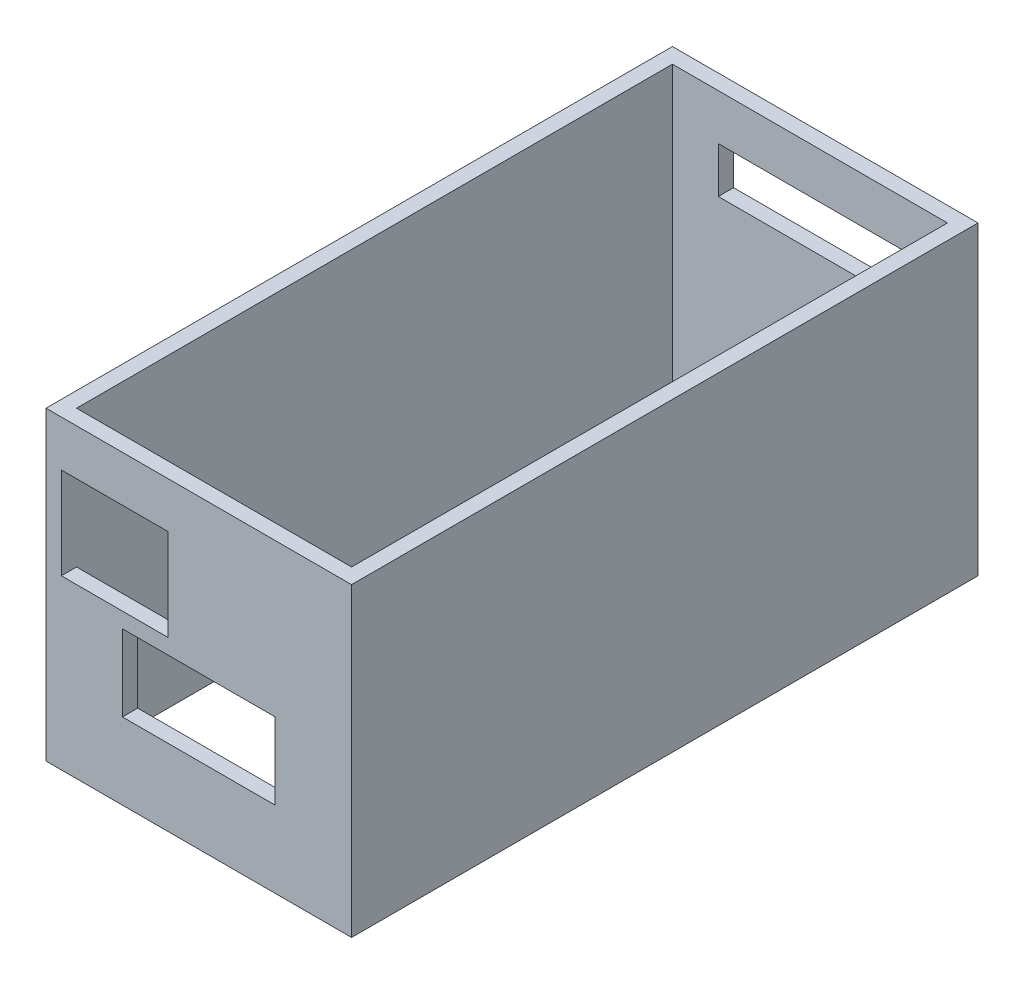
ISO-10303-21;
HEADER;
FILE_DESCRIPTION(('STEP AP214'),'2;1');
FILE_NAME('part.step','',(''),(''),'','','');
FILE_SCHEMA(('AUTOMOTIVE_DESIGN { 1 0 10303 214 1 1 1 1 }'));
ENDSEC;
DATA;
#1=APPLICATION_CONTEXT('core data for automotive mechanical design processes');
#2=APPLICATION_PROTOCOL_DEFINITION('international standard','automotive_design',2000,#1);
#3=PRODUCT_CONTEXT('',#1,'mechanical');
#4=PRODUCT('Part','Part','',(#3));
#5=PRODUCT_RELATED_PRODUCT_CATEGORY('part','',(#4));
#6=PRODUCT_DEFINITION_FORMATION('','',#4);
#7=PRODUCT_DEFINITION_CONTEXT('part definition',#1,'design');
#8=PRODUCT_DEFINITION('design','',#6,#7);
#9=PRODUCT_DEFINITION_SHAPE('','',#8);
#10=(LENGTH_UNIT() NAMED_UNIT(*) SI_UNIT(.MILLI.,.METRE.));
#11=(NAMED_UNIT(*) PLANE_ANGLE_UNIT() SI_UNIT($,.RADIAN.));
#12=(NAMED_UNIT(*) SI_UNIT($,.STERADIAN.) SOLID_ANGLE_UNIT());
#13=UNCERTAINTY_MEASURE_WITH_UNIT(LENGTH_MEASURE(1.E-05),#10,'distance_accuracy_value','');
#14=(GEOMETRIC_REPRESENTATION_CONTEXT(3) GLOBAL_UNCERTAINTY_ASSIGNED_CONTEXT((#13)) GLOBAL_UNIT_ASSIGNED_CONTEXT((#10,
#11,#12)) REPRESENTATION_CONTEXT('',''));
#15=CARTESIAN_POINT('',(0.,0.,0.));
#16=DIRECTION('',(0.,0.,1.));
#17=DIRECTION('',(1.,0.,0.));
#18=AXIS2_PLACEMENT_3D('',#15,#16,#17);
#19=CARTESIAN_POINT('',(-2.,40.,-80.));
#20=DIRECTION('',(0.,0.,1.));
#21=DIRECTION('',(1.,0.,0.));
#22=AXIS2_PLACEMENT_3D('',#19,#20,#21);
#23=PLANE('',#22);
#24=DIRECTION('',(-1.,0.,0.));
#25=VECTOR('',#24,1.);
#26=CARTESIAN_POINT('',(-2.,0.,-80.));
#27=LINE('',#26,#25);
#28=CARTESIAN_POINT('',(38.,0.,-80.));
#29=VERTEX_POINT('',#28);
#30=CARTESIAN_POINT('',(-2.,0.,-80.));
#31=VERTEX_POINT('',#30);
#32=EDGE_CURVE('E396',#29,#31,#27,.T.);
#33=ORIENTED_EDGE('',*,*,#32,.T.);
#34=DIRECTION('',(0.,-1.,0.));
#35=VECTOR('',#34,1.);
#36=CARTESIAN_POINT('',(-2.,40.,-80.));
#37=LINE('',#36,#35);
#38=CARTESIAN_POINT('',(-2.,40.,-80.));
#39=VERTEX_POINT('',#38);
#40=EDGE_CURVE('E402',#39,#31,#37,.T.);
#41=ORIENTED_EDGE('',*,*,#40,.F.);
#42=DIRECTION('',(-1.,0.,0.));
#43=VECTOR('',#42,1.);
#44=CARTESIAN_POINT('',(-2.,40.,-80.));
#45=LINE('',#44,#43);
#46=CARTESIAN_POINT('',(38.,40.,-80.));
#47=VERTEX_POINT('',#46);
#48=EDGE_CURVE('E400',#47,#39,#45,.T.);
#49=ORIENTED_EDGE('',*,*,#48,.F.);
#50=DIRECTION('',(0.,-1.,0.));
#51=VECTOR('',#50,1.);
#52=CARTESIAN_POINT('',(38.,40.,-80.));
#53=LINE('',#52,#51);
#54=EDGE_CURVE('E412',#47,#29,#53,.T.);
#55=ORIENTED_EDGE('',*,*,#54,.T.);
#56=EDGE_LOOP('',(#33,#41,#49,#55));
#57=FACE_BOUND('',#56,.T.);
#58=DIRECTION('',(0.,-1.,0.));
#59=VECTOR('',#58,1.);
#60=CARTESIAN_POINT('',(36.,38.,-80.));
#61=LINE('',#60,#59);
#62=CARTESIAN_POINT('',(36.,38.,-80.));
#63=VERTEX_POINT('',#62);
#64=CARTESIAN_POINT('',(36.,2.,-80.));
#65=VERTEX_POINT('',#64);
#66=EDGE_CURVE('E286',#63,#65,#61,.T.);
#67=ORIENTED_EDGE('',*,*,#66,.F.);
#68=DIRECTION('',(1.,0.,0.));
#69=VECTOR('',#68,1.);
#70=CARTESIAN_POINT('',(36.,38.,-80.));
#71=LINE('',#70,#69);
#72=CARTESIAN_POINT('',(0.,38.,-80.));
#73=VERTEX_POINT('',#72);
#74=EDGE_CURVE('E291',#73,#63,#71,.T.);
#75=ORIENTED_EDGE('',*,*,#74,.F.);
#76=DIRECTION('',(0.,1.,0.));
#77=VECTOR('',#76,1.);
#78=CARTESIAN_POINT('',(0.,38.,-80.));
#79=LINE('',#78,#77);
#80=CARTESIAN_POINT('',(0.,2.,-80.));
#81=VERTEX_POINT('',#80);
#82=EDGE_CURVE('E303',#81,#73,#79,.T.);
#83=ORIENTED_EDGE('',*,*,#82,.F.);
#84=DIRECTION('',(-1.,0.,0.));
#85=VECTOR('',#84,1.);
#86=CARTESIAN_POINT('',(36.,2.,-80.));
#87=LINE('',#86,#85);
#88=EDGE_CURVE('E300',#65,#81,#87,.T.);
#89=ORIENTED_EDGE('',*,*,#88,.F.);
#90=EDGE_LOOP('',(#67,#75,#83,#89));
#91=FACE_BOUND('',#90,.T.);
#92=ADVANCED_FACE('F36',(#57,#91),#23,.F.);
#93=CARTESIAN_POINT('',(0.,40.,0.));
#94=DIRECTION('',(0.,-1.,0.));
#95=DIRECTION('',(0.,0.,-1.));
#96=AXIS2_PLACEMENT_3D('',#93,#94,#95);
#97=PLANE('',#96);
#98=DIRECTION('',(0.,0.,1.));
#99=VECTOR('',#98,1.);
#100=CARTESIAN_POINT('',(-2.,40.,2.));
#101=LINE('',#100,#99);
#102=CARTESIAN_POINT('',(-2.,40.,2.));
#103=VERTEX_POINT('',#102);
#104=EDGE_CURVE('E392',#39,#103,#101,.T.);
#105=ORIENTED_EDGE('',*,*,#104,.T.);
#106=DIRECTION('',(1.,0.,0.));
#107=VECTOR('',#106,1.);
#108=CARTESIAN_POINT('',(-2.,40.,2.));
#109=LINE('',#108,#107);
#110=CARTESIAN_POINT('',(38.,40.,2.));
#111=VERTEX_POINT('',#110);
#112=EDGE_CURVE('E395',#103,#111,#109,.T.);
#113=ORIENTED_EDGE('',*,*,#112,.T.);
#114=DIRECTION('',(0.,0.,-1.));
#115=VECTOR('',#114,1.);
#116=CARTESIAN_POINT('',(38.,40.,2.));
#117=LINE('',#116,#115);
#118=EDGE_CURVE('E398',#111,#47,#117,.T.);
#119=ORIENTED_EDGE('',*,*,#118,.T.);
#120=ORIENTED_EDGE('',*,*,#48,.T.);
#121=EDGE_LOOP('',(#105,#113,#119,#120));
#122=FACE_BOUND('',#121,.T.);
#123=DIRECTION('',(0.,0.,1.));
#124=VECTOR('',#123,1.);
#125=CARTESIAN_POINT('',(0.,40.,0.));
#126=LINE('',#125,#124);
#127=CARTESIAN_POINT('',(0.,40.,-78.));
#128=VERTEX_POINT('',#127);
#129=CARTESIAN_POINT('',(0.,40.,0.));
#130=VERTEX_POINT('',#129);
#131=EDGE_CURVE('E360',#128,#130,#126,.T.);
#132=ORIENTED_EDGE('',*,*,#131,.F.);
#133=DIRECTION('',(-1.,0.,0.));
#134=VECTOR('',#133,1.);
#135=CARTESIAN_POINT('',(0.,40.,-78.));
#136=LINE('',#135,#134);
#137=CARTESIAN_POINT('',(36.,40.,-78.));
#138=VERTEX_POINT('',#137);
#139=EDGE_CURVE('E368',#138,#128,#136,.T.);
#140=ORIENTED_EDGE('',*,*,#139,.F.);
#141=DIRECTION('',(0.,0.,-1.));
#142=VECTOR('',#141,1.);
#143=CARTESIAN_POINT('',(36.,40.,0.));
#144=LINE('',#143,#142);
#145=CARTESIAN_POINT('',(36.,40.,0.));
#146=VERTEX_POINT('',#145);
#147=EDGE_CURVE('E365',#146,#138,#144,.T.);
#148=ORIENTED_EDGE('',*,*,#147,.F.);
#149=DIRECTION('',(1.,0.,0.));
#150=VECTOR('',#149,1.);
#151=CARTESIAN_POINT('',(0.,40.,0.));
#152=LINE('',#151,#150);
#153=EDGE_CURVE('E362',#130,#146,#152,.T.);
#154=ORIENTED_EDGE('',*,*,#153,.F.);
#155=EDGE_LOOP('',(#132,#140,#148,#154));
#156=FACE_BOUND('',#155,.T.);
#157=ADVANCED_FACE('F481',(#122,#156),#97,.F.);
#158=CARTESIAN_POINT('',(0.,0.,0.));
#159=DIRECTION('',(0.,-1.,0.));
#160=DIRECTION('',(0.,0.,-1.));
#161=AXIS2_PLACEMENT_3D('',#158,#159,#160);
#162=PLANE('',#161);
#163=DIRECTION('',(0.,0.,1.));
#164=VECTOR('',#163,1.);
#165=CARTESIAN_POINT('',(-2.,0.,2.));
#166=LINE('',#165,#164);
#167=CARTESIAN_POINT('',(-2.,0.,2.));
#168=VERTEX_POINT('',#167);
#169=EDGE_CURVE('E391',#31,#168,#166,.T.);
#170=ORIENTED_EDGE('',*,*,#169,.F.);
#171=ORIENTED_EDGE('',*,*,#32,.F.);
#172=DIRECTION('',(0.,0.,-1.));
#173=VECTOR('',#172,1.);
#174=CARTESIAN_POINT('',(38.,0.,2.));
#175=LINE('',#174,#173);
#176=CARTESIAN_POINT('',(38.,0.,2.));
#177=VERTEX_POINT('',#176);
#178=EDGE_CURVE('E407',#177,#29,#175,.T.);
#179=ORIENTED_EDGE('',*,*,#178,.F.);
#180=DIRECTION('',(1.,0.,0.));
#181=VECTOR('',#180,1.);
#182=CARTESIAN_POINT('',(-2.,0.,2.));
#183=LINE('',#182,#181);
#184=EDGE_CURVE('E405',#168,#177,#183,.T.);
#185=ORIENTED_EDGE('',*,*,#184,.F.);
#186=EDGE_LOOP('',(#170,#171,#179,#185));
#187=FACE_BOUND('',#186,.T.);
#188=DIRECTION('',(-1.,0.,0.));
#189=VECTOR('',#188,1.);
#190=CARTESIAN_POINT('',(0.,0.,-78.));
#191=LINE('',#190,#189);
#192=CARTESIAN_POINT('',(36.,0.,-78.));
#193=VERTEX_POINT('',#192);
#194=CARTESIAN_POINT('',(0.,0.,-78.));
#195=VERTEX_POINT('',#194);
#196=EDGE_CURVE('E363',#193,#195,#191,.T.);
#197=ORIENTED_EDGE('',*,*,#196,.T.);
#198=DIRECTION('',(0.,0.,1.));
#199=VECTOR('',#198,1.);
#200=CARTESIAN_POINT('',(0.,0.,0.));
#201=LINE('',#200,#199);
#202=CARTESIAN_POINT('',(0.,0.,0.));
#203=VERTEX_POINT('',#202);
#204=EDGE_CURVE('E335',#195,#203,#201,.T.);
#205=ORIENTED_EDGE('',*,*,#204,.T.);
#206=DIRECTION('',(1.,0.,0.));
#207=VECTOR('',#206,1.);
#208=CARTESIAN_POINT('',(0.,0.,0.));
#209=LINE('',#208,#207);
#210=CARTESIAN_POINT('',(36.,0.,0.));
#211=VERTEX_POINT('',#210);
#212=EDGE_CURVE('E373',#203,#211,#209,.T.);
#213=ORIENTED_EDGE('',*,*,#212,.T.);
#214=DIRECTION('',(0.,0.,-1.));
#215=VECTOR('',#214,1.);
#216=CARTESIAN_POINT('',(36.,0.,0.));
#217=LINE('',#216,#215);
#218=EDGE_CURVE('E376',#211,#193,#217,.T.);
#219=ORIENTED_EDGE('',*,*,#218,.T.);
#220=EDGE_LOOP('',(#197,#205,#213,#219));
#221=FACE_BOUND('',#220,.T.);
#222=ADVANCED_FACE('F472',(#187,#221),#162,.T.);
#223=CARTESIAN_POINT('',(-2.,40.,2.));
#224=DIRECTION('',(1.,0.,0.));
#225=DIRECTION('',(0.,0.,-1.));
#226=AXIS2_PLACEMENT_3D('',#223,#224,#225);
#227=PLANE('',#226);
#228=ORIENTED_EDGE('',*,*,#169,.T.);
#229=DIRECTION('',(0.,-1.,0.));
#230=VECTOR('',#229,1.);
#231=CARTESIAN_POINT('',(-2.,40.,2.));
#232=LINE('',#231,#230);
#233=EDGE_CURVE('E418',#103,#168,#232,.T.);
#234=ORIENTED_EDGE('',*,*,#233,.F.);
#235=ORIENTED_EDGE('',*,*,#104,.F.);
#236=ORIENTED_EDGE('',*,*,#40,.T.);
#237=EDGE_LOOP('',(#228,#234,#235,#236));
#238=FACE_BOUND('',#237,.T.);
#239=ADVANCED_FACE('F38',(#238),#227,.F.);
#240=CARTESIAN_POINT('',(-2.,40.,2.));
#241=DIRECTION('',(0.,0.,-1.));
#242=DIRECTION('',(-1.,0.,0.));
#243=AXIS2_PLACEMENT_3D('',#240,#241,#242);
#244=PLANE('',#243);
#245=DIRECTION('',(1.,0.,0.));
#246=VECTOR('',#245,1.);
#247=CARTESIAN_POINT('',(8.,10.,2.));
#248=LINE('',#247,#246);
#249=CARTESIAN_POINT('',(8.,10.,2.));
#250=VERTEX_POINT('',#249);
#251=CARTESIAN_POINT('',(28.,10.,2.));
#252=VERTEX_POINT('',#251);
#253=EDGE_CURVE('E322',#250,#252,#248,.T.);
#254=ORIENTED_EDGE('',*,*,#253,.F.);
#255=DIRECTION('',(0.,-1.,0.));
#256=VECTOR('',#255,1.);
#257=CARTESIAN_POINT('',(8.,20.,2.));
#258=LINE('',#257,#256);
#259=CARTESIAN_POINT('',(8.,20.,2.));
#260=VERTEX_POINT('',#259);
#261=EDGE_CURVE('E320',#260,#250,#258,.T.);
#262=ORIENTED_EDGE('',*,*,#261,.F.);
#263=DIRECTION('',(-1.,0.,0.));
#264=VECTOR('',#263,1.);
#265=CARTESIAN_POINT('',(8.,20.,2.));
#266=LINE('',#265,#264);
#267=CARTESIAN_POINT('',(28.,20.,2.));
#268=VERTEX_POINT('',#267);
#269=EDGE_CURVE('E329',#268,#260,#266,.T.);
#270=ORIENTED_EDGE('',*,*,#269,.F.);
#271=DIRECTION('',(0.,1.,0.));
#272=VECTOR('',#271,1.);
#273=CARTESIAN_POINT('',(28.,20.,2.));
#274=LINE('',#273,#272);
#275=EDGE_CURVE('E326',#252,#268,#274,.T.);
#276=ORIENTED_EDGE('',*,*,#275,.F.);
#277=EDGE_LOOP('',(#254,#262,#270,#276));
#278=FACE_BOUND('',#277,.T.);
#279=DIRECTION('',(1.,0.,0.));
#280=VECTOR('',#279,1.);
#281=CARTESIAN_POINT('',(0.,22.,2.));
#282=LINE('',#281,#280);
#283=CARTESIAN_POINT('',(0.,22.,2.));
#284=VERTEX_POINT('',#283);
#285=CARTESIAN_POINT('',(14.,22.,2.));
#286=VERTEX_POINT('',#285);
#287=EDGE_CURVE('E343',#284,#286,#282,.T.);
#288=ORIENTED_EDGE('',*,*,#287,.F.);
#289=DIRECTION('',(0.,-1.,0.));
#290=VECTOR('',#289,1.);
#291=CARTESIAN_POINT('',(0.,34.,2.));
#292=LINE('',#291,#290);
#293=CARTESIAN_POINT('',(0.,34.,2.));
#294=VERTEX_POINT('',#293);
#295=EDGE_CURVE('E319',#294,#284,#292,.T.);
#296=ORIENTED_EDGE('',*,*,#295,.F.);
#297=DIRECTION('',(-1.,0.,0.));
#298=VECTOR('',#297,1.);
#299=CARTESIAN_POINT('',(0.,34.,2.));
#300=LINE('',#299,#298);
#301=CARTESIAN_POINT('',(14.,34.,2.));
#302=VERTEX_POINT('',#301);
#303=EDGE_CURVE('E349',#302,#294,#300,.T.);
#304=ORIENTED_EDGE('',*,*,#303,.F.);
#305=DIRECTION('',(0.,1.,0.));
#306=VECTOR('',#305,1.);
#307=CARTESIAN_POINT('',(14.,34.,2.));
#308=LINE('',#307,#306);
#309=EDGE_CURVE('E346',#286,#302,#308,.T.);
#310=ORIENTED_EDGE('',*,*,#309,.F.);
#311=EDGE_LOOP('',(#288,#296,#304,#310));
#312=FACE_BOUND('',#311,.T.);
#313=ORIENTED_EDGE('',*,*,#184,.T.);
#314=DIRECTION('',(0.,-1.,0.));
#315=VECTOR('',#314,1.);
#316=CARTESIAN_POINT('',(38.,40.,2.));
#317=LINE('',#316,#315);
#318=EDGE_CURVE('E415',#111,#177,#317,.T.);
#319=ORIENTED_EDGE('',*,*,#318,.F.);
#320=ORIENTED_EDGE('',*,*,#112,.F.);
#321=ORIENTED_EDGE('',*,*,#233,.T.);
#322=EDGE_LOOP('',(#313,#319,#320,#321));
#323=FACE_BOUND('',#322,.T.);
#324=ADVANCED_FACE('F455',(#278,#312,#323),#244,.F.);
#325=CARTESIAN_POINT('',(38.,40.,2.));
#326=DIRECTION('',(-1.,0.,0.));
#327=DIRECTION('',(0.,0.,1.));
#328=AXIS2_PLACEMENT_3D('',#325,#326,#327);
#329=PLANE('',#328);
#330=ORIENTED_EDGE('',*,*,#178,.T.);
#331=ORIENTED_EDGE('',*,*,#54,.F.);
#332=ORIENTED_EDGE('',*,*,#118,.F.);
#333=ORIENTED_EDGE('',*,*,#318,.T.);
#334=EDGE_LOOP('',(#330,#331,#332,#333));
#335=FACE_BOUND('',#334,.T.);
#336=ADVANCED_FACE('F458',(#335),#329,.F.);
#337=CARTESIAN_POINT('',(0.,40.,0.));
#338=DIRECTION('',(1.,0.,0.));
#339=DIRECTION('',(0.,0.,-1.));
#340=AXIS2_PLACEMENT_3D('',#337,#338,#339);
#341=PLANE('',#340);
#342=DIRECTION('',(0.,-1.,0.));
#343=VECTOR('',#342,1.);
#344=CARTESIAN_POINT('',(0.,40.,0.));
#345=LINE('',#344,#343);
#346=CARTESIAN_POINT('',(0.,34.,0.));
#347=VERTEX_POINT('',#346);
#348=EDGE_CURVE('E388',#130,#347,#345,.T.);
#349=ORIENTED_EDGE('',*,*,#348,.T.);
#350=DIRECTION('',(0.,0.,1.));
#351=VECTOR('',#350,1.);
#352=CARTESIAN_POINT('',(0.,34.,-18.));
#353=LINE('',#352,#351);
#354=EDGE_CURVE('E323',#347,#294,#353,.T.);
#355=ORIENTED_EDGE('',*,*,#354,.T.);
#356=ORIENTED_EDGE('',*,*,#295,.T.);
#357=DIRECTION('',(0.,0.,1.));
#358=VECTOR('',#357,1.);
#359=CARTESIAN_POINT('',(0.,22.,-18.));
#360=LINE('',#359,#358);
#361=CARTESIAN_POINT('',(0.,22.,0.));
#362=VERTEX_POINT('',#361);
#363=EDGE_CURVE('E352',#362,#284,#360,.T.);
#364=ORIENTED_EDGE('',*,*,#363,.F.);
#365=EDGE_CURVE('E387',#362,#203,#345,.T.);
#366=ORIENTED_EDGE('',*,*,#365,.T.);
#367=ORIENTED_EDGE('',*,*,#204,.F.);
#368=DIRECTION('',(0.,-1.,0.));
#369=VECTOR('',#368,1.);
#370=CARTESIAN_POINT('',(0.,40.,-78.));
#371=LINE('',#370,#369);
#372=EDGE_CURVE('E370',#128,#195,#371,.T.);
#373=ORIENTED_EDGE('',*,*,#372,.F.);
#374=ORIENTED_EDGE('',*,*,#131,.T.);
#375=EDGE_LOOP('',(#349,#355,#356,#364,#366,#367,#373,#374));
#376=FACE_BOUND('',#375,.T.);
#377=ADVANCED_FACE('F492',(#376),#341,.T.);
#378=CARTESIAN_POINT('',(0.,40.,0.));
#379=DIRECTION('',(0.,0.,-1.));
#380=DIRECTION('',(-1.,0.,0.));
#381=AXIS2_PLACEMENT_3D('',#378,#379,#380);
#382=PLANE('',#381);
#383=DIRECTION('',(0.,1.,0.));
#384=VECTOR('',#383,1.);
#385=CARTESIAN_POINT('',(8.,40.,0.));
#386=LINE('',#385,#384);
#387=CARTESIAN_POINT('',(8.,10.,0.));
#388=VERTEX_POINT('',#387);
#389=CARTESIAN_POINT('',(8.,20.,0.));
#390=VERTEX_POINT('',#389);
#391=EDGE_CURVE('E11',#388,#390,#386,.T.);
#392=ORIENTED_EDGE('',*,*,#391,.F.);
#393=DIRECTION('',(-1.,0.,0.));
#394=VECTOR('',#393,1.);
#395=CARTESIAN_POINT('',(0.,10.,0.));
#396=LINE('',#395,#394);
#397=CARTESIAN_POINT('',(28.,10.,0.));
#398=VERTEX_POINT('',#397);
#399=EDGE_CURVE('E428',#398,#388,#396,.T.);
#400=ORIENTED_EDGE('',*,*,#399,.F.);
#401=DIRECTION('',(0.,-1.,0.));
#402=VECTOR('',#401,1.);
#403=CARTESIAN_POINT('',(28.,40.,0.));
#404=LINE('',#403,#402);
#405=CARTESIAN_POINT('',(28.,20.,0.));
#406=VERTEX_POINT('',#405);
#407=EDGE_CURVE('E430',#406,#398,#404,.T.);
#408=ORIENTED_EDGE('',*,*,#407,.F.);
#409=DIRECTION('',(1.,0.,0.));
#410=VECTOR('',#409,1.);
#411=CARTESIAN_POINT('',(0.,20.,0.));
#412=LINE('',#411,#410);
#413=EDGE_CURVE('E44',#390,#406,#412,.T.);
#414=ORIENTED_EDGE('',*,*,#413,.F.);
#415=EDGE_LOOP('',(#392,#400,#408,#414));
#416=FACE_BOUND('',#415,.T.);
#417=DIRECTION('',(1.,0.,0.));
#418=VECTOR('',#417,1.);
#419=CARTESIAN_POINT('',(0.,34.,0.));
#420=LINE('',#419,#418);
#421=CARTESIAN_POINT('',(14.,34.,0.));
#422=VERTEX_POINT('',#421);
#423=EDGE_CURVE('E426',#347,#422,#420,.T.);
#424=ORIENTED_EDGE('',*,*,#423,.F.);
#425=ORIENTED_EDGE('',*,*,#348,.F.);
#426=ORIENTED_EDGE('',*,*,#153,.T.);
#427=DIRECTION('',(0.,-1.,0.));
#428=VECTOR('',#427,1.);
#429=CARTESIAN_POINT('',(36.,40.,0.));
#430=LINE('',#429,#428);
#431=EDGE_CURVE('E385',#146,#211,#430,.T.);
#432=ORIENTED_EDGE('',*,*,#431,.T.);
#433=ORIENTED_EDGE('',*,*,#212,.F.);
#434=ORIENTED_EDGE('',*,*,#365,.F.);
#435=DIRECTION('',(-1.,0.,0.));
#436=VECTOR('',#435,1.);
#437=CARTESIAN_POINT('',(0.,22.,0.));
#438=LINE('',#437,#436);
#439=CARTESIAN_POINT('',(14.,22.,0.));
#440=VERTEX_POINT('',#439);
#441=EDGE_CURVE('E421',#440,#362,#438,.T.);
#442=ORIENTED_EDGE('',*,*,#441,.F.);
#443=DIRECTION('',(0.,-1.,0.));
#444=VECTOR('',#443,1.);
#445=CARTESIAN_POINT('',(14.,40.,0.));
#446=LINE('',#445,#444);
#447=EDGE_CURVE('E423',#422,#440,#446,.T.);
#448=ORIENTED_EDGE('',*,*,#447,.F.);
#449=EDGE_LOOP('',(#424,#425,#426,#432,#433,#434,#442,#448));
#450=FACE_BOUND('',#449,.T.);
#451=ADVANCED_FACE('F445',(#416,#450),#382,.T.);
#452=CARTESIAN_POINT('',(36.,40.,0.));
#453=DIRECTION('',(-1.,0.,0.));
#454=DIRECTION('',(0.,0.,1.));
#455=AXIS2_PLACEMENT_3D('',#452,#453,#454);
#456=PLANE('',#455);
#457=ORIENTED_EDGE('',*,*,#218,.F.);
#458=ORIENTED_EDGE('',*,*,#431,.F.);
#459=ORIENTED_EDGE('',*,*,#147,.T.);
#460=DIRECTION('',(0.,-1.,0.));
#461=VECTOR('',#460,1.);
#462=CARTESIAN_POINT('',(36.,40.,-78.));
#463=LINE('',#462,#461);
#464=EDGE_CURVE('E383',#138,#193,#463,.T.);
#465=ORIENTED_EDGE('',*,*,#464,.T.);
#466=EDGE_LOOP('',(#457,#458,#459,#465));
#467=FACE_BOUND('',#466,.T.);
#468=ADVANCED_FACE('F511',(#467),#456,.T.);
#469=CARTESIAN_POINT('',(0.,40.,-78.));
#470=DIRECTION('',(0.,0.,1.));
#471=DIRECTION('',(1.,0.,0.));
#472=AXIS2_PLACEMENT_3D('',#469,#470,#471);
#473=PLANE('',#472);
#474=DIRECTION('',(0.,-1.,0.));
#475=VECTOR('',#474,1.);
#476=CARTESIAN_POINT('',(30.,34.,-78.));
#477=LINE('',#476,#475);
#478=CARTESIAN_POINT('',(30.,34.,-78.));
#479=VERTEX_POINT('',#478);
#480=CARTESIAN_POINT('',(30.,28.,-78.));
#481=VERTEX_POINT('',#480);
#482=EDGE_CURVE('E222',#479,#481,#477,.T.);
#483=ORIENTED_EDGE('',*,*,#482,.T.);
#484=DIRECTION('',(-1.,0.,0.));
#485=VECTOR('',#484,1.);
#486=CARTESIAN_POINT('',(30.,28.,-78.));
#487=LINE('',#486,#485);
#488=CARTESIAN_POINT('',(6.,28.,-78.));
#489=VERTEX_POINT('',#488);
#490=EDGE_CURVE('E231',#481,#489,#487,.T.);
#491=ORIENTED_EDGE('',*,*,#490,.T.);
#492=DIRECTION('',(0.,1.,0.));
#493=VECTOR('',#492,1.);
#494=CARTESIAN_POINT('',(6.,34.,-78.));
#495=LINE('',#494,#493);
#496=CARTESIAN_POINT('',(6.,34.,-78.));
#497=VERTEX_POINT('',#496);
#498=EDGE_CURVE('E51',#489,#497,#495,.T.);
#499=ORIENTED_EDGE('',*,*,#498,.T.);
#500=DIRECTION('',(1.,0.,0.));
#501=VECTOR('',#500,1.);
#502=CARTESIAN_POINT('',(30.,34.,-78.));
#503=LINE('',#502,#501);
#504=EDGE_CURVE('E228',#497,#479,#503,.T.);
#505=ORIENTED_EDGE('',*,*,#504,.T.);
#506=EDGE_LOOP('',(#483,#491,#499,#505));
#507=FACE_BOUND('',#506,.T.);
#508=ORIENTED_EDGE('',*,*,#196,.F.);
#509=ORIENTED_EDGE('',*,*,#464,.F.);
#510=ORIENTED_EDGE('',*,*,#139,.T.);
#511=ORIENTED_EDGE('',*,*,#372,.T.);
#512=EDGE_LOOP('',(#508,#509,#510,#511));
#513=FACE_BOUND('',#512,.T.);
#514=ADVANCED_FACE('F235',(#507,#513),#473,.T.);
#515=CARTESIAN_POINT('',(0.,34.,-18.));
#516=DIRECTION('',(0.,1.,0.));
#517=DIRECTION('',(0.,0.,1.));
#518=AXIS2_PLACEMENT_3D('',#515,#516,#517);
#519=PLANE('',#518);
#520=ORIENTED_EDGE('',*,*,#423,.T.);
#521=DIRECTION('',(0.,0.,1.));
#522=VECTOR('',#521,1.);
#523=CARTESIAN_POINT('',(14.,34.,-18.));
#524=LINE('',#523,#522);
#525=EDGE_CURVE('E354',#422,#302,#524,.T.);
#526=ORIENTED_EDGE('',*,*,#525,.T.);
#527=ORIENTED_EDGE('',*,*,#303,.T.);
#528=ORIENTED_EDGE('',*,*,#354,.F.);
#529=EDGE_LOOP('',(#520,#526,#527,#528));
#530=FACE_BOUND('',#529,.T.);
#531=ADVANCED_FACE('F499',(#530),#519,.F.);
#532=CARTESIAN_POINT('',(14.,34.,-18.));
#533=DIRECTION('',(1.,0.,0.));
#534=DIRECTION('',(0.,1.,0.));
#535=AXIS2_PLACEMENT_3D('',#532,#533,#534);
#536=PLANE('',#535);
#537=ORIENTED_EDGE('',*,*,#447,.T.);
#538=DIRECTION('',(0.,0.,1.));
#539=VECTOR('',#538,1.);
#540=CARTESIAN_POINT('',(14.,22.,-18.));
#541=LINE('',#540,#539);
#542=EDGE_CURVE('E356',#440,#286,#541,.T.);
#543=ORIENTED_EDGE('',*,*,#542,.T.);
#544=ORIENTED_EDGE('',*,*,#309,.T.);
#545=ORIENTED_EDGE('',*,*,#525,.F.);
#546=EDGE_LOOP('',(#537,#543,#544,#545));
#547=FACE_BOUND('',#546,.T.);
#548=ADVANCED_FACE('F501',(#547),#536,.F.);
#549=CARTESIAN_POINT('',(0.,22.,-18.));
#550=DIRECTION('',(0.,-1.,0.));
#551=DIRECTION('',(1.,0.,0.));
#552=AXIS2_PLACEMENT_3D('',#549,#550,#551);
#553=PLANE('',#552);
#554=ORIENTED_EDGE('',*,*,#441,.T.);
#555=ORIENTED_EDGE('',*,*,#363,.T.);
#556=ORIENTED_EDGE('',*,*,#287,.T.);
#557=ORIENTED_EDGE('',*,*,#542,.F.);
#558=EDGE_LOOP('',(#554,#555,#556,#557));
#559=FACE_BOUND('',#558,.T.);
#560=ADVANCED_FACE('F506',(#559),#553,.F.);
#561=CARTESIAN_POINT('',(8.,20.,-18.));
#562=DIRECTION('',(-1.,0.,0.));
#563=DIRECTION('',(0.,-1.,0.));
#564=AXIS2_PLACEMENT_3D('',#561,#562,#563);
#565=PLANE('',#564);
#566=ORIENTED_EDGE('',*,*,#391,.T.);
#567=DIRECTION('',(0.,0.,1.));
#568=VECTOR('',#567,1.);
#569=CARTESIAN_POINT('',(8.,20.,-18.));
#570=LINE('',#569,#568);
#571=EDGE_CURVE('E333',#390,#260,#570,.T.);
#572=ORIENTED_EDGE('',*,*,#571,.T.);
#573=ORIENTED_EDGE('',*,*,#261,.T.);
#574=DIRECTION('',(0.,0.,1.));
#575=VECTOR('',#574,1.);
#576=CARTESIAN_POINT('',(8.,10.,-18.));
#577=LINE('',#576,#575);
#578=EDGE_CURVE('E332',#388,#250,#577,.T.);
#579=ORIENTED_EDGE('',*,*,#578,.F.);
#580=EDGE_LOOP('',(#566,#572,#573,#579));
#581=FACE_BOUND('',#580,.T.);
#582=ADVANCED_FACE('F452',(#581),#565,.F.);
#583=CARTESIAN_POINT('',(8.,20.,-18.));
#584=DIRECTION('',(0.,1.,0.));
#585=DIRECTION('',(-1.,0.,0.));
#586=AXIS2_PLACEMENT_3D('',#583,#584,#585);
#587=PLANE('',#586);
#588=ORIENTED_EDGE('',*,*,#413,.T.);
#589=DIRECTION('',(0.,0.,1.));
#590=VECTOR('',#589,1.);
#591=CARTESIAN_POINT('',(28.,20.,-18.));
#592=LINE('',#591,#590);
#593=EDGE_CURVE('E336',#406,#268,#592,.T.);
#594=ORIENTED_EDGE('',*,*,#593,.T.);
#595=ORIENTED_EDGE('',*,*,#269,.T.);
#596=ORIENTED_EDGE('',*,*,#571,.F.);
#597=EDGE_LOOP('',(#588,#594,#595,#596));
#598=FACE_BOUND('',#597,.T.);
#599=ADVANCED_FACE('F436',(#598),#587,.F.);
#600=CARTESIAN_POINT('',(28.,20.,-18.));
#601=DIRECTION('',(1.,0.,0.));
#602=DIRECTION('',(0.,1.,0.));
#603=AXIS2_PLACEMENT_3D('',#600,#601,#602);
#604=PLANE('',#603);
#605=ORIENTED_EDGE('',*,*,#407,.T.);
#606=DIRECTION('',(0.,0.,1.));
#607=VECTOR('',#606,1.);
#608=CARTESIAN_POINT('',(28.,10.,-18.));
#609=LINE('',#608,#607);
#610=EDGE_CURVE('E338',#398,#252,#609,.T.);
#611=ORIENTED_EDGE('',*,*,#610,.T.);
#612=ORIENTED_EDGE('',*,*,#275,.T.);
#613=ORIENTED_EDGE('',*,*,#593,.F.);
#614=EDGE_LOOP('',(#605,#611,#612,#613));
#615=FACE_BOUND('',#614,.T.);
#616=ADVANCED_FACE('F441',(#615),#604,.F.);
#617=CARTESIAN_POINT('',(8.,10.,-18.));
#618=DIRECTION('',(0.,-1.,0.));
#619=DIRECTION('',(0.,0.,-1.));
#620=AXIS2_PLACEMENT_3D('',#617,#618,#619);
#621=PLANE('',#620);
#622=ORIENTED_EDGE('',*,*,#399,.T.);
#623=ORIENTED_EDGE('',*,*,#578,.T.);
#624=ORIENTED_EDGE('',*,*,#253,.T.);
#625=ORIENTED_EDGE('',*,*,#610,.F.);
#626=EDGE_LOOP('',(#622,#623,#624,#625));
#627=FACE_BOUND('',#626,.T.);
#628=ADVANCED_FACE('F449',(#627),#621,.F.);
#629=CARTESIAN_POINT('',(0.,0.,-82.));
#630=DIRECTION('',(0.,0.,-1.));
#631=DIRECTION('',(-1.,0.,0.));
#632=AXIS2_PLACEMENT_3D('',#629,#630,#631);
#633=PLANE('',#632);
#634=DIRECTION('',(0.,-1.,0.));
#635=VECTOR('',#634,1.);
#636=CARTESIAN_POINT('',(36.,38.,-82.));
#637=LINE('',#636,#635);
#638=CARTESIAN_POINT('',(36.,38.,-82.));
#639=VERTEX_POINT('',#638);
#640=CARTESIAN_POINT('',(36.,2.,-82.));
#641=VERTEX_POINT('',#640);
#642=EDGE_CURVE('E287',#639,#641,#637,.T.);
#643=ORIENTED_EDGE('',*,*,#642,.T.);
#644=DIRECTION('',(-1.,0.,0.));
#645=VECTOR('',#644,1.);
#646=CARTESIAN_POINT('',(36.,2.,-82.));
#647=LINE('',#646,#645);
#648=CARTESIAN_POINT('',(0.,2.,-82.));
#649=VERTEX_POINT('',#648);
#650=EDGE_CURVE('E290',#641,#649,#647,.T.);
#651=ORIENTED_EDGE('',*,*,#650,.T.);
#652=DIRECTION('',(0.,1.,0.));
#653=VECTOR('',#652,1.);
#654=CARTESIAN_POINT('',(0.,38.,-82.));
#655=LINE('',#654,#653);
#656=CARTESIAN_POINT('',(0.,38.,-82.));
#657=VERTEX_POINT('',#656);
#658=EDGE_CURVE('E293',#649,#657,#655,.T.);
#659=ORIENTED_EDGE('',*,*,#658,.T.);
#660=DIRECTION('',(1.,0.,0.));
#661=VECTOR('',#660,1.);
#662=CARTESIAN_POINT('',(36.,38.,-82.));
#663=LINE('',#662,#661);
#664=EDGE_CURVE('E295',#657,#639,#663,.T.);
#665=ORIENTED_EDGE('',*,*,#664,.T.);
#666=EDGE_LOOP('',(#643,#651,#659,#665));
#667=FACE_BOUND('',#666,.T.);
#668=DIRECTION('',(-1.,0.,0.));
#669=VECTOR('',#668,1.);
#670=CARTESIAN_POINT('',(34.,4.,-82.));
#671=LINE('',#670,#669);
#672=CARTESIAN_POINT('',(34.,4.,-82.));
#673=VERTEX_POINT('',#672);
#674=CARTESIAN_POINT('',(2.,4.,-82.));
#675=VERTEX_POINT('',#674);
#676=EDGE_CURVE('E259',#673,#675,#671,.T.);
#677=ORIENTED_EDGE('',*,*,#676,.F.);
#678=DIRECTION('',(0.,-1.,0.));
#679=VECTOR('',#678,1.);
#680=CARTESIAN_POINT('',(34.,36.,-82.));
#681=LINE('',#680,#679);
#682=CARTESIAN_POINT('',(34.,36.,-82.));
#683=VERTEX_POINT('',#682);
#684=EDGE_CURVE('E257',#683,#673,#681,.T.);
#685=ORIENTED_EDGE('',*,*,#684,.F.);
#686=DIRECTION('',(1.,0.,0.));
#687=VECTOR('',#686,1.);
#688=CARTESIAN_POINT('',(34.,36.,-82.));
#689=LINE('',#688,#687);
#690=CARTESIAN_POINT('',(2.,36.,-82.));
#691=VERTEX_POINT('',#690);
#692=EDGE_CURVE('E265',#691,#683,#689,.T.);
#693=ORIENTED_EDGE('',*,*,#692,.F.);
#694=DIRECTION('',(0.,1.,0.));
#695=VECTOR('',#694,1.);
#696=CARTESIAN_POINT('',(2.,36.,-82.));
#697=LINE('',#696,#695);
#698=EDGE_CURVE('E262',#675,#691,#697,.T.);
#699=ORIENTED_EDGE('',*,*,#698,.F.);
#700=EDGE_LOOP('',(#677,#685,#693,#699));
#701=FACE_BOUND('',#700,.T.);
#702=ADVANCED_FACE('F556',(#667,#701),#633,.T.);
#703=CARTESIAN_POINT('',(36.,38.,-82.));
#704=DIRECTION('',(-1.,0.,0.));
#705=DIRECTION('',(0.,-1.,0.));
#706=AXIS2_PLACEMENT_3D('',#703,#704,#705);
#707=PLANE('',#706);
#708=ORIENTED_EDGE('',*,*,#66,.T.);
#709=DIRECTION('',(0.,0.,1.));
#710=VECTOR('',#709,1.);
#711=CARTESIAN_POINT('',(36.,2.,-82.));
#712=LINE('',#711,#710);
#713=EDGE_CURVE('E316',#641,#65,#712,.T.);
#714=ORIENTED_EDGE('',*,*,#713,.F.);
#715=ORIENTED_EDGE('',*,*,#642,.F.);
#716=DIRECTION('',(0.,0.,1.));
#717=VECTOR('',#716,1.);
#718=CARTESIAN_POINT('',(36.,38.,-82.));
#719=LINE('',#718,#717);
#720=EDGE_CURVE('E297',#639,#63,#719,.T.);
#721=ORIENTED_EDGE('',*,*,#720,.T.);
#722=EDGE_LOOP('',(#708,#714,#715,#721));
#723=FACE_BOUND('',#722,.T.);
#724=ADVANCED_FACE('F570',(#723),#707,.F.);
#725=CARTESIAN_POINT('',(36.,2.,-82.));
#726=DIRECTION('',(0.,1.,0.));
#727=DIRECTION('',(0.,0.,1.));
#728=AXIS2_PLACEMENT_3D('',#725,#726,#727);
#729=PLANE('',#728);
#730=ORIENTED_EDGE('',*,*,#88,.T.);
#731=DIRECTION('',(0.,0.,1.));
#732=VECTOR('',#731,1.);
#733=CARTESIAN_POINT('',(0.,2.,-82.));
#734=LINE('',#733,#732);
#735=EDGE_CURVE('E313',#649,#81,#734,.T.);
#736=ORIENTED_EDGE('',*,*,#735,.F.);
#737=ORIENTED_EDGE('',*,*,#650,.F.);
#738=ORIENTED_EDGE('',*,*,#713,.T.);
#739=EDGE_LOOP('',(#730,#736,#737,#738));
#740=FACE_BOUND('',#739,.T.);
#741=ADVANCED_FACE('F578',(#740),#729,.F.);
#742=CARTESIAN_POINT('',(0.,38.,-82.));
#743=DIRECTION('',(1.,0.,0.));
#744=DIRECTION('',(0.,1.,0.));
#745=AXIS2_PLACEMENT_3D('',#742,#743,#744);
#746=PLANE('',#745);
#747=ORIENTED_EDGE('',*,*,#82,.T.);
#748=DIRECTION('',(0.,0.,1.));
#749=VECTOR('',#748,1.);
#750=CARTESIAN_POINT('',(0.,38.,-82.));
#751=LINE('',#750,#749);
#752=EDGE_CURVE('E310',#657,#73,#751,.T.);
#753=ORIENTED_EDGE('',*,*,#752,.F.);
#754=ORIENTED_EDGE('',*,*,#658,.F.);
#755=ORIENTED_EDGE('',*,*,#735,.T.);
#756=EDGE_LOOP('',(#747,#753,#754,#755));
#757=FACE_BOUND('',#756,.T.);
#758=ADVANCED_FACE('F574',(#757),#746,.F.);
#759=CARTESIAN_POINT('',(36.,38.,-82.));
#760=DIRECTION('',(0.,-1.,0.));
#761=DIRECTION('',(0.,0.,-1.));
#762=AXIS2_PLACEMENT_3D('',#759,#760,#761);
#763=PLANE('',#762);
#764=ORIENTED_EDGE('',*,*,#74,.T.);
#765=ORIENTED_EDGE('',*,*,#720,.F.);
#766=ORIENTED_EDGE('',*,*,#664,.F.);
#767=ORIENTED_EDGE('',*,*,#752,.T.);
#768=EDGE_LOOP('',(#764,#765,#766,#767));
#769=FACE_BOUND('',#768,.T.);
#770=ADVANCED_FACE('F567',(#769),#763,.F.);
#771=CARTESIAN_POINT('',(34.,36.,-82.));
#772=DIRECTION('',(-1.,0.,0.));
#773=DIRECTION('',(0.,0.,1.));
#774=AXIS2_PLACEMENT_3D('',#771,#772,#773);
#775=PLANE('',#774);
#776=DIRECTION('',(0.,-1.,0.));
#777=VECTOR('',#776,1.);
#778=CARTESIAN_POINT('',(34.,36.,-80.));
#779=LINE('',#778,#777);
#780=CARTESIAN_POINT('',(34.,36.,-80.));
#781=VERTEX_POINT('',#780);
#782=CARTESIAN_POINT('',(34.,4.,-80.));
#783=VERTEX_POINT('',#782);
#784=EDGE_CURVE('E253',#781,#783,#779,.T.);
#785=ORIENTED_EDGE('',*,*,#784,.F.);
#786=DIRECTION('',(0.,0.,1.));
#787=VECTOR('',#786,1.);
#788=CARTESIAN_POINT('',(34.,36.,-82.));
#789=LINE('',#788,#787);
#790=EDGE_CURVE('E267',#683,#781,#789,.T.);
#791=ORIENTED_EDGE('',*,*,#790,.F.);
#792=ORIENTED_EDGE('',*,*,#684,.T.);
#793=DIRECTION('',(0.,0.,1.));
#794=VECTOR('',#793,1.);
#795=CARTESIAN_POINT('',(34.,4.,-82.));
#796=LINE('',#795,#794);
#797=EDGE_CURVE('E283',#673,#783,#796,.T.);
#798=ORIENTED_EDGE('',*,*,#797,.T.);
#799=EDGE_LOOP('',(#785,#791,#792,#798));
#800=FACE_BOUND('',#799,.T.);
#801=ADVANCED_FACE('F548',(#800),#775,.T.);
#802=CARTESIAN_POINT('',(34.,4.,-82.));
#803=DIRECTION('',(0.,1.,0.));
#804=DIRECTION('',(-1.,0.,0.));
#805=AXIS2_PLACEMENT_3D('',#802,#803,#804);
#806=PLANE('',#805);
#807=DIRECTION('',(-1.,0.,0.));
#808=VECTOR('',#807,1.);
#809=CARTESIAN_POINT('',(34.,4.,-80.));
#810=LINE('',#809,#808);
#811=CARTESIAN_POINT('',(2.,4.,-80.));
#812=VERTEX_POINT('',#811);
#813=EDGE_CURVE('E270',#783,#812,#810,.T.);
#814=ORIENTED_EDGE('',*,*,#813,.F.);
#815=ORIENTED_EDGE('',*,*,#797,.F.);
#816=ORIENTED_EDGE('',*,*,#676,.T.);
#817=DIRECTION('',(0.,0.,1.));
#818=VECTOR('',#817,1.);
#819=CARTESIAN_POINT('',(2.,4.,-82.));
#820=LINE('',#819,#818);
#821=EDGE_CURVE('E281',#675,#812,#820,.T.);
#822=ORIENTED_EDGE('',*,*,#821,.T.);
#823=EDGE_LOOP('',(#814,#815,#816,#822));
#824=FACE_BOUND('',#823,.T.);
#825=ADVANCED_FACE('F552',(#824),#806,.T.);
#826=CARTESIAN_POINT('',(2.,36.,-82.));
#827=DIRECTION('',(1.,0.,0.));
#828=DIRECTION('',(0.,1.,0.));
#829=AXIS2_PLACEMENT_3D('',#826,#827,#828);
#830=PLANE('',#829);
#831=DIRECTION('',(0.,1.,0.));
#832=VECTOR('',#831,1.);
#833=CARTESIAN_POINT('',(2.,36.,-80.));
#834=LINE('',#833,#832);
#835=CARTESIAN_POINT('',(2.,36.,-80.));
#836=VERTEX_POINT('',#835);
#837=EDGE_CURVE('E273',#812,#836,#834,.T.);
#838=ORIENTED_EDGE('',*,*,#837,.F.);
#839=ORIENTED_EDGE('',*,*,#821,.F.);
#840=ORIENTED_EDGE('',*,*,#698,.T.);
#841=DIRECTION('',(0.,0.,1.));
#842=VECTOR('',#841,1.);
#843=CARTESIAN_POINT('',(2.,36.,-82.));
#844=LINE('',#843,#842);
#845=EDGE_CURVE('E279',#691,#836,#844,.T.);
#846=ORIENTED_EDGE('',*,*,#845,.T.);
#847=EDGE_LOOP('',(#838,#839,#840,#846));
#848=FACE_BOUND('',#847,.T.);
#849=ADVANCED_FACE('F536',(#848),#830,.T.);
#850=CARTESIAN_POINT('',(34.,36.,-82.));
#851=DIRECTION('',(0.,-1.,0.));
#852=DIRECTION('',(0.,0.,-1.));
#853=AXIS2_PLACEMENT_3D('',#850,#851,#852);
#854=PLANE('',#853);
#855=DIRECTION('',(1.,0.,0.));
#856=VECTOR('',#855,1.);
#857=CARTESIAN_POINT('',(34.,36.,-80.));
#858=LINE('',#857,#856);
#859=EDGE_CURVE('E260',#836,#781,#858,.T.);
#860=ORIENTED_EDGE('',*,*,#859,.F.);
#861=ORIENTED_EDGE('',*,*,#845,.F.);
#862=ORIENTED_EDGE('',*,*,#692,.T.);
#863=ORIENTED_EDGE('',*,*,#790,.T.);
#864=EDGE_LOOP('',(#860,#861,#862,#863));
#865=FACE_BOUND('',#864,.T.);
#866=ADVANCED_FACE('F528',(#865),#854,.T.);
#867=DIRECTION('',(-1.,0.,0.));
#868=VECTOR('',#867,1.);
#869=CARTESIAN_POINT('',(30.,28.,-80.));
#870=LINE('',#869,#868);
#871=CARTESIAN_POINT('',(30.,28.,-80.));
#872=VERTEX_POINT('',#871);
#873=CARTESIAN_POINT('',(6.,28.,-80.));
#874=VERTEX_POINT('',#873);
#875=EDGE_CURVE('E247',#872,#874,#870,.T.);
#876=ORIENTED_EDGE('',*,*,#875,.F.);
#877=DIRECTION('',(0.,-1.,0.));
#878=VECTOR('',#877,1.);
#879=CARTESIAN_POINT('',(30.,34.,-80.));
#880=LINE('',#879,#878);
#881=CARTESIAN_POINT('',(30.,34.,-80.));
#882=VERTEX_POINT('',#881);
#883=EDGE_CURVE('E59',#882,#872,#880,.T.);
#884=ORIENTED_EDGE('',*,*,#883,.F.);
#885=DIRECTION('',(1.,0.,0.));
#886=VECTOR('',#885,1.);
#887=CARTESIAN_POINT('',(30.,34.,-80.));
#888=LINE('',#887,#886);
#889=CARTESIAN_POINT('',(6.,34.,-80.));
#890=VERTEX_POINT('',#889);
#891=EDGE_CURVE('E238',#890,#882,#888,.T.);
#892=ORIENTED_EDGE('',*,*,#891,.F.);
#893=DIRECTION('',(0.,1.,0.));
#894=VECTOR('',#893,1.);
#895=CARTESIAN_POINT('',(6.,34.,-80.));
#896=LINE('',#895,#894);
#897=EDGE_CURVE('E241',#874,#890,#896,.T.);
#898=ORIENTED_EDGE('',*,*,#897,.F.);
#899=EDGE_LOOP('',(#876,#884,#892,#898));
#900=FACE_BOUND('',#899,.T.);
#901=ORIENTED_EDGE('',*,*,#859,.T.);
#902=ORIENTED_EDGE('',*,*,#784,.T.);
#903=ORIENTED_EDGE('',*,*,#813,.T.);
#904=ORIENTED_EDGE('',*,*,#837,.T.);
#905=EDGE_LOOP('',(#901,#902,#903,#904));
#906=FACE_BOUND('',#905,.T.);
#907=ADVANCED_FACE('F522',(#900,#906),#23,.F.);
#908=CARTESIAN_POINT('',(30.,34.,-78.));
#909=DIRECTION('',(1.,0.,0.));
#910=DIRECTION('',(0.,0.,-1.));
#911=AXIS2_PLACEMENT_3D('',#908,#909,#910);
#912=PLANE('',#911);
#913=ORIENTED_EDGE('',*,*,#883,.T.);
#914=DIRECTION('',(0.,0.,-1.));
#915=VECTOR('',#914,1.);
#916=CARTESIAN_POINT('',(30.,28.,-78.));
#917=LINE('',#916,#915);
#918=EDGE_CURVE('E218',#481,#872,#917,.T.);
#919=ORIENTED_EDGE('',*,*,#918,.F.);
#920=ORIENTED_EDGE('',*,*,#482,.F.);
#921=DIRECTION('',(0.,0.,-1.));
#922=VECTOR('',#921,1.);
#923=CARTESIAN_POINT('',(30.,34.,-78.));
#924=LINE('',#923,#922);
#925=EDGE_CURVE('E251',#479,#882,#924,.T.);
#926=ORIENTED_EDGE('',*,*,#925,.T.);
#927=EDGE_LOOP('',(#913,#919,#920,#926));
#928=FACE_BOUND('',#927,.T.);
#929=ADVANCED_FACE('F220',(#928),#912,.F.);
#930=CARTESIAN_POINT('',(30.,34.,-78.));
#931=DIRECTION('',(0.,1.,0.));
#932=DIRECTION('',(0.,0.,1.));
#933=AXIS2_PLACEMENT_3D('',#930,#931,#932);
#934=PLANE('',#933);
#935=ORIENTED_EDGE('',*,*,#891,.T.);
#936=ORIENTED_EDGE('',*,*,#925,.F.);
#937=ORIENTED_EDGE('',*,*,#504,.F.);
#938=DIRECTION('',(0.,0.,-1.));
#939=VECTOR('',#938,1.);
#940=CARTESIAN_POINT('',(6.,34.,-78.));
#941=LINE('',#940,#939);
#942=EDGE_CURVE('E254',#497,#890,#941,.T.);
#943=ORIENTED_EDGE('',*,*,#942,.T.);
#944=EDGE_LOOP('',(#935,#936,#937,#943));
#945=FACE_BOUND('',#944,.T.);
#946=ADVANCED_FACE('F534',(#945),#934,.F.);
#947=CARTESIAN_POINT('',(6.,34.,-78.));
#948=DIRECTION('',(-1.,0.,0.));
#949=DIRECTION('',(0.,0.,1.));
#950=AXIS2_PLACEMENT_3D('',#947,#948,#949);
#951=PLANE('',#950);
#952=ORIENTED_EDGE('',*,*,#897,.T.);
#953=ORIENTED_EDGE('',*,*,#942,.F.);
#954=ORIENTED_EDGE('',*,*,#498,.F.);
#955=DIRECTION('',(0.,0.,-1.));
#956=VECTOR('',#955,1.);
#957=CARTESIAN_POINT('',(6.,28.,-78.));
#958=LINE('',#957,#956);
#959=EDGE_CURVE('E227',#489,#874,#958,.T.);
#960=ORIENTED_EDGE('',*,*,#959,.T.);
#961=EDGE_LOOP('',(#952,#953,#954,#960));
#962=FACE_BOUND('',#961,.T.);
#963=ADVANCED_FACE('F686',(#962),#951,.F.);
#964=CARTESIAN_POINT('',(30.,28.,-78.));
#965=DIRECTION('',(0.,-1.,0.));
#966=DIRECTION('',(0.,0.,-1.));
#967=AXIS2_PLACEMENT_3D('',#964,#965,#966);
#968=PLANE('',#967);
#969=ORIENTED_EDGE('',*,*,#875,.T.);
#970=ORIENTED_EDGE('',*,*,#959,.F.);
#971=ORIENTED_EDGE('',*,*,#490,.F.);
#972=ORIENTED_EDGE('',*,*,#918,.T.);
#973=EDGE_LOOP('',(#969,#970,#971,#972));
#974=FACE_BOUND('',#973,.T.);
#975=ADVANCED_FACE('F232',(#974),#968,.F.);
#976=CLOSED_SHELL('',(#92,#157,#222,#239,#324,#336,#377,#451,#468,#514,#531,#548,#560,#582,#599,
#616,#628,#702,#724,#741,#758,#770,#801,#825,#849,#866,#907,#929,#946,#963,#975));
#977=MANIFOLD_SOLID_BREP('B2',#976);
#978=ADVANCED_BREP_SHAPE_REPRESENTATION('',(#18,#977),#14);
#979=SHAPE_DEFINITION_REPRESENTATION(#9,#978);
ENDSEC;
END-ISO-10303-21;
